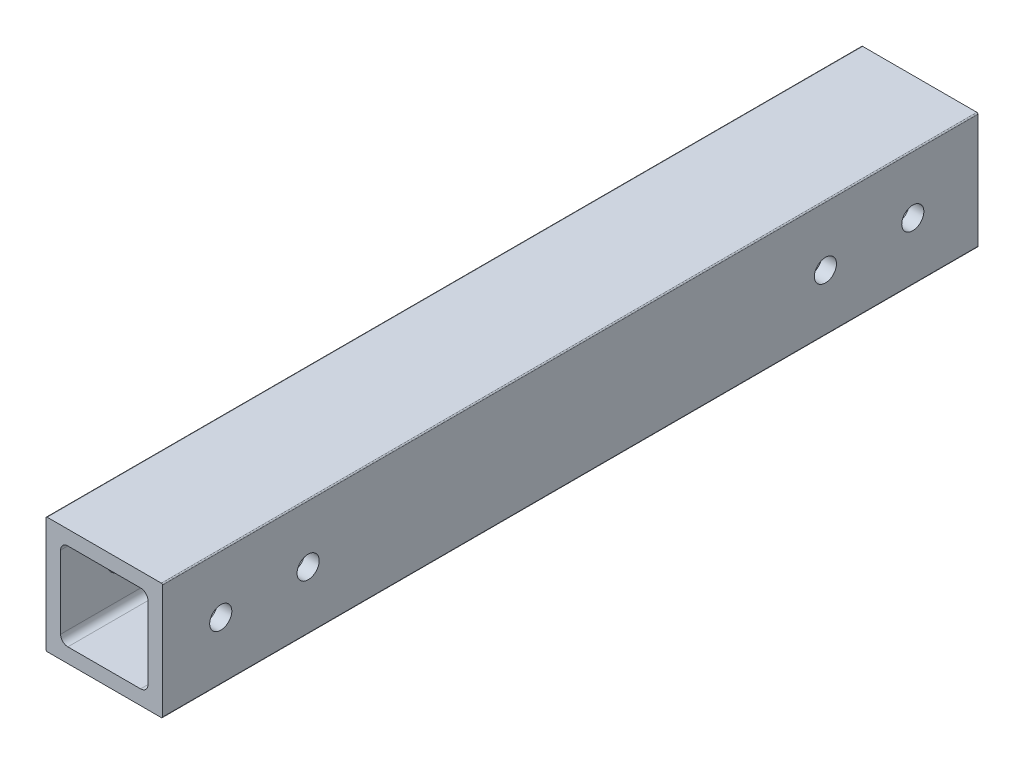
ISO-10303-21;
HEADER;
FILE_DESCRIPTION(('STEP AP214'),'2;1');
FILE_NAME('part.step','',(''),(''),'','','');
FILE_SCHEMA(('AUTOMOTIVE_DESIGN { 1 0 10303 214 1 1 1 1 }'));
ENDSEC;
DATA;
#1=APPLICATION_CONTEXT('core data for automotive mechanical design processes');
#2=APPLICATION_PROTOCOL_DEFINITION('international standard','automotive_design',2000,#1);
#3=PRODUCT_CONTEXT('',#1,'mechanical');
#4=PRODUCT('Part','Part','',(#3));
#5=PRODUCT_RELATED_PRODUCT_CATEGORY('part','',(#4));
#6=PRODUCT_DEFINITION_FORMATION('','',#4);
#7=PRODUCT_DEFINITION_CONTEXT('part definition',#1,'design');
#8=PRODUCT_DEFINITION('design','',#6,#7);
#9=PRODUCT_DEFINITION_SHAPE('','',#8);
#10=(LENGTH_UNIT() NAMED_UNIT(*) SI_UNIT(.MILLI.,.METRE.));
#11=(NAMED_UNIT(*) PLANE_ANGLE_UNIT() SI_UNIT($,.RADIAN.));
#12=(NAMED_UNIT(*) SI_UNIT($,.STERADIAN.) SOLID_ANGLE_UNIT());
#13=UNCERTAINTY_MEASURE_WITH_UNIT(LENGTH_MEASURE(1.E-05),#10,'distance_accuracy_value','');
#14=(GEOMETRIC_REPRESENTATION_CONTEXT(3) GLOBAL_UNCERTAINTY_ASSIGNED_CONTEXT((#13)) GLOBAL_UNIT_ASSIGNED_CONTEXT((#10,
#11,#12)) REPRESENTATION_CONTEXT('',''));
#15=CARTESIAN_POINT('',(0.,0.,0.));
#16=DIRECTION('',(0.,0.,1.));
#17=DIRECTION('',(1.,0.,0.));
#18=AXIS2_PLACEMENT_3D('',#15,#16,#17);
#19=CARTESIAN_POINT('',(3.175,4.7625,1828.8));
#20=DIRECTION('',(1.,0.,0.));
#21=DIRECTION('',(0.,1.,0.));
#22=AXIS2_PLACEMENT_3D('',#19,#20,#21);
#23=PLANE('',#22);
#24=CARTESIAN_POINT('',(3.175,12.7000000000002,1665.21621166384));
#25=DIRECTION('',(1.,0.,0.));
#26=DIRECTION('',(0.,0.,-1.));
#27=AXIS2_PLACEMENT_3D('',#24,#25,#26);
#28=CIRCLE('',#27,2.41299999999989);
#29=CARTESIAN_POINT('',(3.175,12.7000000000002,1662.80321166384));
#30=VERTEX_POINT('',#29);
#31=EDGE_CURVE('E316',#30,#30,#28,.T.);
#32=ORIENTED_EDGE('',*,*,#31,.F.);
#33=EDGE_LOOP('',(#32));
#34=FACE_BOUND('',#33,.T.);
#35=CARTESIAN_POINT('',(3.175,12.6999999999983,1797.05));
#36=DIRECTION('',(1.,0.,0.));
#37=DIRECTION('',(0.,0.,-1.));
#38=AXIS2_PLACEMENT_3D('',#35,#36,#37);
#39=CIRCLE('',#38,2.41299999999989);
#40=CARTESIAN_POINT('',(3.175,12.6999999999983,1794.637));
#41=VERTEX_POINT('',#40);
#42=EDGE_CURVE('E301',#41,#41,#39,.T.);
#43=ORIENTED_EDGE('',*,*,#42,.F.);
#44=EDGE_LOOP('',(#43));
#45=FACE_BOUND('',#44,.T.);
#46=CARTESIAN_POINT('',(3.175,12.6999999999983,1816.1));
#47=DIRECTION('',(1.,0.,0.));
#48=DIRECTION('',(0.,0.,-1.));
#49=AXIS2_PLACEMENT_3D('',#46,#47,#48);
#50=CIRCLE('',#49,2.41299999999989);
#51=CARTESIAN_POINT('',(3.175,12.6999999999983,1813.687));
#52=VERTEX_POINT('',#51);
#53=EDGE_CURVE('E297',#52,#52,#50,.T.);
#54=ORIENTED_EDGE('',*,*,#53,.F.);
#55=EDGE_LOOP('',(#54));
#56=FACE_BOUND('',#55,.T.);
#57=CARTESIAN_POINT('',(3.175,12.3513725490198,1684.26621166384));
#58=DIRECTION('',(1.,0.,0.));
#59=DIRECTION('',(0.,0.,-1.));
#60=AXIS2_PLACEMENT_3D('',#57,#58,#59);
#61=CIRCLE('',#60,2.4130000000001);
#62=CARTESIAN_POINT('',(3.175,12.3513725490198,1681.85321166384));
#63=VERTEX_POINT('',#62);
#64=EDGE_CURVE('E293',#63,#63,#61,.T.);
#65=ORIENTED_EDGE('',*,*,#64,.F.);
#66=EDGE_LOOP('',(#65));
#67=FACE_BOUND('',#66,.T.);
#68=DIRECTION('',(0.,-1.,0.));
#69=VECTOR('',#68,1.);
#70=CARTESIAN_POINT('',(3.175,4.7625,1651.));
#71=LINE('',#70,#69);
#72=CARTESIAN_POINT('',(3.175,20.6375,1651.));
#73=VERTEX_POINT('',#72);
#74=CARTESIAN_POINT('',(3.175,4.7625,1651.));
#75=VERTEX_POINT('',#74);
#76=EDGE_CURVE('E59',#73,#75,#71,.T.);
#77=ORIENTED_EDGE('',*,*,#76,.F.);
#78=DIRECTION('',(0.,0.,-1.));
#79=VECTOR('',#78,1.);
#80=CARTESIAN_POINT('',(3.175,20.6375,1828.8));
#81=LINE('',#80,#79);
#82=CARTESIAN_POINT('',(3.175,20.6375,1828.8));
#83=VERTEX_POINT('',#82);
#84=EDGE_CURVE('E51',#83,#73,#81,.T.);
#85=ORIENTED_EDGE('',*,*,#84,.F.);
#86=DIRECTION('',(0.,-1.,0.));
#87=VECTOR('',#86,1.);
#88=CARTESIAN_POINT('',(3.175,4.7625,1828.8));
#89=LINE('',#88,#87);
#90=CARTESIAN_POINT('',(3.175,4.7625,1828.8));
#91=VERTEX_POINT('',#90);
#92=EDGE_CURVE('E218',#83,#91,#89,.T.);
#93=ORIENTED_EDGE('',*,*,#92,.T.);
#94=DIRECTION('',(0.,0.,-1.));
#95=VECTOR('',#94,1.);
#96=CARTESIAN_POINT('',(3.175,4.7625,1828.8));
#97=LINE('',#96,#95);
#98=EDGE_CURVE('E344',#91,#75,#97,.T.);
#99=ORIENTED_EDGE('',*,*,#98,.T.);
#100=EDGE_LOOP('',(#77,#85,#93,#99));
#101=FACE_BOUND('',#100,.T.);
#102=ADVANCED_FACE('F42',(#34,#45,#56,#67,#101),#23,.T.);
#103=CARTESIAN_POINT('',(4.7625,20.6375,1828.8));
#104=DIRECTION('',(0.,0.,-1.));
#105=DIRECTION('',(-1.,0.,0.));
#106=AXIS2_PLACEMENT_3D('',#103,#104,#105);
#107=CYLINDRICAL_SURFACE('',#106,1.5875);
#108=ORIENTED_EDGE('',*,*,#84,.T.);
#109=CARTESIAN_POINT('',(4.7625,20.6375,1651.));
#110=DIRECTION('',(0.,0.,1.));
#111=DIRECTION('',(1.,0.,0.));
#112=AXIS2_PLACEMENT_3D('',#109,#110,#111);
#113=CIRCLE('',#112,1.5875);
#114=CARTESIAN_POINT('',(4.7625,22.225,1651.));
#115=VERTEX_POINT('',#114);
#116=EDGE_CURVE('E340',#73,#115,#113,.F.);
#117=ORIENTED_EDGE('',*,*,#116,.T.);
#118=DIRECTION('',(0.,0.,-1.));
#119=VECTOR('',#118,1.);
#120=CARTESIAN_POINT('',(4.7625,22.225,1828.8));
#121=LINE('',#120,#119);
#122=CARTESIAN_POINT('',(4.7625,22.225,1828.8));
#123=VERTEX_POINT('',#122);
#124=EDGE_CURVE('E351',#123,#115,#121,.T.);
#125=ORIENTED_EDGE('',*,*,#124,.F.);
#126=CARTESIAN_POINT('',(4.7625,20.6375,1828.8));
#127=DIRECTION('',(0.,0.,1.));
#128=DIRECTION('',(-1.,0.,0.));
#129=AXIS2_PLACEMENT_3D('',#126,#127,#128);
#130=CIRCLE('',#129,1.5875);
#131=EDGE_CURVE('E223',#123,#83,#130,.T.);
#132=ORIENTED_EDGE('',*,*,#131,.T.);
#133=EDGE_LOOP('',(#108,#117,#125,#132));
#134=FACE_BOUND('',#133,.T.);
#135=ADVANCED_FACE('F400',(#134),#107,.F.);
#136=CARTESIAN_POINT('',(4.7625,22.225,1828.8));
#137=DIRECTION('',(0.,-1.,0.));
#138=DIRECTION('',(0.,0.,-1.));
#139=AXIS2_PLACEMENT_3D('',#136,#137,#138);
#140=PLANE('',#139);
#141=DIRECTION('',(-1.,0.,0.));
#142=VECTOR('',#141,1.);
#143=CARTESIAN_POINT('',(4.7625,22.225,1651.));
#144=LINE('',#143,#142);
#145=CARTESIAN_POINT('',(20.6375,22.225,1651.));
#146=VERTEX_POINT('',#145);
#147=EDGE_CURVE('E338',#146,#115,#144,.T.);
#148=ORIENTED_EDGE('',*,*,#147,.F.);
#149=DIRECTION('',(0.,0.,-1.));
#150=VECTOR('',#149,1.);
#151=CARTESIAN_POINT('',(20.6375,22.225,1828.8));
#152=LINE('',#151,#150);
#153=CARTESIAN_POINT('',(20.6375,22.225,1828.8));
#154=VERTEX_POINT('',#153);
#155=EDGE_CURVE('E238',#154,#146,#152,.T.);
#156=ORIENTED_EDGE('',*,*,#155,.F.);
#157=DIRECTION('',(-1.,0.,0.));
#158=VECTOR('',#157,1.);
#159=CARTESIAN_POINT('',(4.7625,22.225,1828.8));
#160=LINE('',#159,#158);
#161=EDGE_CURVE('E227',#154,#123,#160,.T.);
#162=ORIENTED_EDGE('',*,*,#161,.T.);
#163=ORIENTED_EDGE('',*,*,#124,.T.);
#164=EDGE_LOOP('',(#148,#156,#162,#163));
#165=FACE_BOUND('',#164,.T.);
#166=ADVANCED_FACE('F396',(#165),#140,.T.);
#167=CARTESIAN_POINT('',(20.6375,20.6375,1828.8));
#168=DIRECTION('',(0.,0.,-1.));
#169=DIRECTION('',(-1.,0.,0.));
#170=AXIS2_PLACEMENT_3D('',#167,#168,#169);
#171=CYLINDRICAL_SURFACE('',#170,1.5875);
#172=ORIENTED_EDGE('',*,*,#155,.T.);
#173=CARTESIAN_POINT('',(20.6375,20.6375,1651.));
#174=DIRECTION('',(0.,0.,1.));
#175=DIRECTION('',(1.,0.,0.));
#176=AXIS2_PLACEMENT_3D('',#173,#174,#175);
#177=CIRCLE('',#176,1.5875);
#178=CARTESIAN_POINT('',(22.225,20.6375,1651.));
#179=VERTEX_POINT('',#178);
#180=EDGE_CURVE('E335',#146,#179,#177,.F.);
#181=ORIENTED_EDGE('',*,*,#180,.T.);
#182=DIRECTION('',(0.,0.,-1.));
#183=VECTOR('',#182,1.);
#184=CARTESIAN_POINT('',(22.225,20.6375,1828.8));
#185=LINE('',#184,#183);
#186=CARTESIAN_POINT('',(22.225,20.6375,1828.8));
#187=VERTEX_POINT('',#186);
#188=EDGE_CURVE('E234',#187,#179,#185,.T.);
#189=ORIENTED_EDGE('',*,*,#188,.F.);
#190=CARTESIAN_POINT('',(20.6375,20.6375,1828.8));
#191=DIRECTION('',(0.,0.,1.));
#192=DIRECTION('',(-1.,0.,0.));
#193=AXIS2_PLACEMENT_3D('',#190,#191,#192);
#194=CIRCLE('',#193,1.5875);
#195=EDGE_CURVE('E213',#187,#154,#194,.T.);
#196=ORIENTED_EDGE('',*,*,#195,.T.);
#197=EDGE_LOOP('',(#172,#181,#189,#196));
#198=FACE_BOUND('',#197,.T.);
#199=ADVANCED_FACE('F392',(#198),#171,.F.);
#200=CARTESIAN_POINT('',(22.225,4.7625,1828.8));
#201=DIRECTION('',(-1.,0.,0.));
#202=DIRECTION('',(0.,0.,1.));
#203=AXIS2_PLACEMENT_3D('',#200,#201,#202);
#204=PLANE('',#203);
#205=CARTESIAN_POINT('',(22.225,12.7000000000002,1665.21621166384));
#206=DIRECTION('',(-1.,0.,0.));
#207=DIRECTION('',(0.,0.,1.));
#208=AXIS2_PLACEMENT_3D('',#205,#206,#207);
#209=CIRCLE('',#208,2.41299999999989);
#210=CARTESIAN_POINT('',(22.225,12.7000000000002,1667.62921166384));
#211=VERTEX_POINT('',#210);
#212=EDGE_CURVE('E313',#211,#211,#209,.T.);
#213=ORIENTED_EDGE('',*,*,#212,.F.);
#214=EDGE_LOOP('',(#213));
#215=FACE_BOUND('',#214,.T.);
#216=CARTESIAN_POINT('',(22.225,12.6999999999983,1797.05));
#217=DIRECTION('',(-1.,0.,0.));
#218=DIRECTION('',(0.,0.,1.));
#219=AXIS2_PLACEMENT_3D('',#216,#217,#218);
#220=CIRCLE('',#219,2.41299999999989);
#221=CARTESIAN_POINT('',(22.225,12.6999999999983,1799.463));
#222=VERTEX_POINT('',#221);
#223=EDGE_CURVE('E296',#222,#222,#220,.T.);
#224=ORIENTED_EDGE('',*,*,#223,.F.);
#225=EDGE_LOOP('',(#224));
#226=FACE_BOUND('',#225,.T.);
#227=CARTESIAN_POINT('',(22.225,12.6999999999983,1816.1));
#228=DIRECTION('',(-1.,0.,0.));
#229=DIRECTION('',(0.,0.,1.));
#230=AXIS2_PLACEMENT_3D('',#227,#228,#229);
#231=CIRCLE('',#230,2.41299999999989);
#232=CARTESIAN_POINT('',(22.225,12.6999999999983,1818.513));
#233=VERTEX_POINT('',#232);
#234=EDGE_CURVE('E292',#233,#233,#231,.T.);
#235=ORIENTED_EDGE('',*,*,#234,.F.);
#236=EDGE_LOOP('',(#235));
#237=FACE_BOUND('',#236,.T.);
#238=CARTESIAN_POINT('',(22.225,12.3513725490198,1684.26621166384));
#239=DIRECTION('',(-1.,0.,0.));
#240=DIRECTION('',(0.,0.,1.));
#241=AXIS2_PLACEMENT_3D('',#238,#239,#240);
#242=CIRCLE('',#241,2.4130000000001);
#243=CARTESIAN_POINT('',(22.225,12.3513725490198,1686.67921166384));
#244=VERTEX_POINT('',#243);
#245=EDGE_CURVE('E288',#244,#244,#242,.T.);
#246=ORIENTED_EDGE('',*,*,#245,.F.);
#247=EDGE_LOOP('',(#246));
#248=FACE_BOUND('',#247,.T.);
#249=DIRECTION('',(0.,1.,0.));
#250=VECTOR('',#249,1.);
#251=CARTESIAN_POINT('',(22.225,4.7625,1651.));
#252=LINE('',#251,#250);
#253=CARTESIAN_POINT('',(22.225,4.7625,1651.));
#254=VERTEX_POINT('',#253);
#255=EDGE_CURVE('E333',#254,#179,#252,.T.);
#256=ORIENTED_EDGE('',*,*,#255,.F.);
#257=DIRECTION('',(0.,0.,-1.));
#258=VECTOR('',#257,1.);
#259=CARTESIAN_POINT('',(22.225,4.7625,1828.8));
#260=LINE('',#259,#258);
#261=CARTESIAN_POINT('',(22.225,4.7625,1828.8));
#262=VERTEX_POINT('',#261);
#263=EDGE_CURVE('E239',#262,#254,#260,.T.);
#264=ORIENTED_EDGE('',*,*,#263,.F.);
#265=DIRECTION('',(0.,1.,0.));
#266=VECTOR('',#265,1.);
#267=CARTESIAN_POINT('',(22.225,4.7625,1828.8));
#268=LINE('',#267,#266);
#269=EDGE_CURVE('E209',#262,#187,#268,.T.);
#270=ORIENTED_EDGE('',*,*,#269,.T.);
#271=ORIENTED_EDGE('',*,*,#188,.T.);
#272=EDGE_LOOP('',(#256,#264,#270,#271));
#273=FACE_BOUND('',#272,.T.);
#274=ADVANCED_FACE('F390',(#215,#226,#237,#248,#273),#204,.T.);
#275=CARTESIAN_POINT('',(20.6375,4.7625,1828.8));
#276=DIRECTION('',(0.,0.,-1.));
#277=DIRECTION('',(-1.,0.,0.));
#278=AXIS2_PLACEMENT_3D('',#275,#276,#277);
#279=CYLINDRICAL_SURFACE('',#278,1.5875);
#280=ORIENTED_EDGE('',*,*,#263,.T.);
#281=CARTESIAN_POINT('',(20.6375,4.7625,1651.));
#282=DIRECTION('',(0.,0.,1.));
#283=DIRECTION('',(1.,0.,0.));
#284=AXIS2_PLACEMENT_3D('',#281,#282,#283);
#285=CIRCLE('',#284,1.5875);
#286=CARTESIAN_POINT('',(20.6375,3.175,1651.));
#287=VERTEX_POINT('',#286);
#288=EDGE_CURVE('E330',#254,#287,#285,.F.);
#289=ORIENTED_EDGE('',*,*,#288,.T.);
#290=DIRECTION('',(0.,0.,-1.));
#291=VECTOR('',#290,1.);
#292=CARTESIAN_POINT('',(20.6375,3.175,1828.8));
#293=LINE('',#292,#291);
#294=CARTESIAN_POINT('',(20.6375,3.175,1828.8));
#295=VERTEX_POINT('',#294);
#296=EDGE_CURVE('E265',#295,#287,#293,.T.);
#297=ORIENTED_EDGE('',*,*,#296,.F.);
#298=CARTESIAN_POINT('',(20.6375,4.7625,1828.8));
#299=DIRECTION('',(0.,0.,1.));
#300=DIRECTION('',(-1.,0.,0.));
#301=AXIS2_PLACEMENT_3D('',#298,#299,#300);
#302=CIRCLE('',#301,1.5875);
#303=EDGE_CURVE('E212',#295,#262,#302,.T.);
#304=ORIENTED_EDGE('',*,*,#303,.T.);
#305=EDGE_LOOP('',(#280,#289,#297,#304));
#306=FACE_BOUND('',#305,.T.);
#307=ADVANCED_FACE('F387',(#306),#279,.F.);
#308=CARTESIAN_POINT('',(4.7625,3.175,1828.8));
#309=DIRECTION('',(0.,1.,0.));
#310=DIRECTION('',(1.,0.,0.));
#311=AXIS2_PLACEMENT_3D('',#308,#309,#310);
#312=PLANE('',#311);
#313=DIRECTION('',(1.,0.,0.));
#314=VECTOR('',#313,1.);
#315=CARTESIAN_POINT('',(4.7625,3.175,1651.));
#316=LINE('',#315,#314);
#317=CARTESIAN_POINT('',(4.7625,3.175,1651.));
#318=VERTEX_POINT('',#317);
#319=EDGE_CURVE('E328',#318,#287,#316,.T.);
#320=ORIENTED_EDGE('',*,*,#319,.F.);
#321=DIRECTION('',(0.,0.,-1.));
#322=VECTOR('',#321,1.);
#323=CARTESIAN_POINT('',(4.7625,3.175,1828.8));
#324=LINE('',#323,#322);
#325=CARTESIAN_POINT('',(4.7625,3.175,1828.8));
#326=VERTEX_POINT('',#325);
#327=EDGE_CURVE('E269',#326,#318,#324,.T.);
#328=ORIENTED_EDGE('',*,*,#327,.F.);
#329=DIRECTION('',(1.,0.,0.));
#330=VECTOR('',#329,1.);
#331=CARTESIAN_POINT('',(4.7625,3.175,1828.8));
#332=LINE('',#331,#330);
#333=EDGE_CURVE('E255',#326,#295,#332,.T.);
#334=ORIENTED_EDGE('',*,*,#333,.T.);
#335=ORIENTED_EDGE('',*,*,#296,.T.);
#336=EDGE_LOOP('',(#320,#328,#334,#335));
#337=FACE_BOUND('',#336,.T.);
#338=ADVANCED_FACE('F378',(#337),#312,.T.);
#339=CARTESIAN_POINT('',(4.7625,4.7625,1828.8));
#340=DIRECTION('',(0.,0.,-1.));
#341=DIRECTION('',(-1.,0.,0.));
#342=AXIS2_PLACEMENT_3D('',#339,#340,#341);
#343=CYLINDRICAL_SURFACE('',#342,1.5875);
#344=ORIENTED_EDGE('',*,*,#327,.T.);
#345=CARTESIAN_POINT('',(4.7625,4.7625,1651.));
#346=DIRECTION('',(0.,0.,1.));
#347=DIRECTION('',(1.,0.,0.));
#348=AXIS2_PLACEMENT_3D('',#345,#346,#347);
#349=CIRCLE('',#348,1.5875);
#350=EDGE_CURVE('E326',#318,#75,#349,.F.);
#351=ORIENTED_EDGE('',*,*,#350,.T.);
#352=ORIENTED_EDGE('',*,*,#98,.F.);
#353=CARTESIAN_POINT('',(4.7625,4.7625,1828.8));
#354=DIRECTION('',(0.,0.,1.));
#355=DIRECTION('',(1.,0.,0.));
#356=AXIS2_PLACEMENT_3D('',#353,#354,#355);
#357=CIRCLE('',#356,1.5875);
#358=EDGE_CURVE('E214',#91,#326,#357,.T.);
#359=ORIENTED_EDGE('',*,*,#358,.T.);
#360=EDGE_LOOP('',(#344,#351,#352,#359));
#361=FACE_BOUND('',#360,.T.);
#362=ADVANCED_FACE('F373',(#361),#343,.F.);
#363=CARTESIAN_POINT('',(0.,0.254,1828.8));
#364=DIRECTION('',(1.,0.,0.));
#365=DIRECTION('',(0.,1.,0.));
#366=AXIS2_PLACEMENT_3D('',#363,#364,#365);
#367=PLANE('',#366);
#368=CARTESIAN_POINT('',(0.,12.7000000000002,1665.21621166384));
#369=DIRECTION('',(1.,0.,0.));
#370=DIRECTION('',(0.,0.,-1.));
#371=AXIS2_PLACEMENT_3D('',#368,#369,#370);
#372=CIRCLE('',#371,2.41299999999989);
#373=CARTESIAN_POINT('',(0.,12.7000000000002,1662.80321166384));
#374=VERTEX_POINT('',#373);
#375=EDGE_CURVE('E289',#374,#374,#372,.T.);
#376=ORIENTED_EDGE('',*,*,#375,.T.);
#377=EDGE_LOOP('',(#376));
#378=FACE_BOUND('',#377,.T.);
#379=CARTESIAN_POINT('',(0.,12.6999999999983,1797.05));
#380=DIRECTION('',(1.,0.,0.));
#381=DIRECTION('',(0.,0.,-1.));
#382=AXIS2_PLACEMENT_3D('',#379,#380,#381);
#383=CIRCLE('',#382,2.41299999999989);
#384=CARTESIAN_POINT('',(0.,12.6999999999983,1794.637));
#385=VERTEX_POINT('',#384);
#386=EDGE_CURVE('E579',#385,#385,#383,.T.);
#387=ORIENTED_EDGE('',*,*,#386,.T.);
#388=EDGE_LOOP('',(#387));
#389=FACE_BOUND('',#388,.T.);
#390=CARTESIAN_POINT('',(0.,12.6999999999983,1816.1));
#391=DIRECTION('',(1.,0.,0.));
#392=DIRECTION('',(0.,0.,-1.));
#393=AXIS2_PLACEMENT_3D('',#390,#391,#392);
#394=CIRCLE('',#393,2.41299999999989);
#395=CARTESIAN_POINT('',(0.,12.6999999999983,1813.687));
#396=VERTEX_POINT('',#395);
#397=EDGE_CURVE('E576',#396,#396,#394,.T.);
#398=ORIENTED_EDGE('',*,*,#397,.T.);
#399=EDGE_LOOP('',(#398));
#400=FACE_BOUND('',#399,.T.);
#401=CARTESIAN_POINT('',(0.,12.3513725490198,1684.26621166384));
#402=DIRECTION('',(1.,0.,0.));
#403=DIRECTION('',(0.,0.,-1.));
#404=AXIS2_PLACEMENT_3D('',#401,#402,#403);
#405=CIRCLE('',#404,2.4130000000001);
#406=CARTESIAN_POINT('',(0.,12.3513725490198,1681.85321166384));
#407=VERTEX_POINT('',#406);
#408=EDGE_CURVE('E573',#407,#407,#405,.T.);
#409=ORIENTED_EDGE('',*,*,#408,.T.);
#410=EDGE_LOOP('',(#409));
#411=FACE_BOUND('',#410,.T.);
#412=DIRECTION('',(0.,0.,-1.));
#413=VECTOR('',#412,1.);
#414=CARTESIAN_POINT('',(0.,25.146,1828.8));
#415=LINE('',#414,#413);
#416=CARTESIAN_POINT('',(0.,25.146,1828.8));
#417=VERTEX_POINT('',#416);
#418=CARTESIAN_POINT('',(0.,25.146,1651.));
#419=VERTEX_POINT('',#418);
#420=EDGE_CURVE('E264',#417,#419,#415,.T.);
#421=ORIENTED_EDGE('',*,*,#420,.T.);
#422=DIRECTION('',(0.,-1.,0.));
#423=VECTOR('',#422,1.);
#424=CARTESIAN_POINT('',(0.,0.254,1651.));
#425=LINE('',#424,#423);
#426=CARTESIAN_POINT('',(0.,0.254,1651.));
#427=VERTEX_POINT('',#426);
#428=EDGE_CURVE('E186',#419,#427,#425,.T.);
#429=ORIENTED_EDGE('',*,*,#428,.T.);
#430=DIRECTION('',(0.,0.,-1.));
#431=VECTOR('',#430,1.);
#432=CARTESIAN_POINT('',(0.,0.254,1828.8));
#433=LINE('',#432,#431);
#434=CARTESIAN_POINT('',(0.,0.254,1828.8));
#435=VERTEX_POINT('',#434);
#436=EDGE_CURVE('E195',#435,#427,#433,.T.);
#437=ORIENTED_EDGE('',*,*,#436,.F.);
#438=DIRECTION('',(0.,-1.,0.));
#439=VECTOR('',#438,1.);
#440=CARTESIAN_POINT('',(0.,0.254,1828.8));
#441=LINE('',#440,#439);
#442=EDGE_CURVE('E219',#417,#435,#441,.T.);
#443=ORIENTED_EDGE('',*,*,#442,.F.);
#444=EDGE_LOOP('',(#421,#429,#437,#443));
#445=FACE_BOUND('',#444,.T.);
#446=ADVANCED_FACE('F433',(#378,#389,#400,#411,#445),#367,.F.);
#447=CARTESIAN_POINT('',(0.254,25.146,1828.8));
#448=DIRECTION('',(0.,0.,-1.));
#449=DIRECTION('',(-1.,0.,0.));
#450=AXIS2_PLACEMENT_3D('',#447,#448,#449);
#451=CYLINDRICAL_SURFACE('',#450,0.254);
#452=CARTESIAN_POINT('',(0.254,25.146,1651.));
#453=DIRECTION('',(0.,0.,1.));
#454=DIRECTION('',(1.,0.,0.));
#455=AXIS2_PLACEMENT_3D('',#452,#453,#454);
#456=CIRCLE('',#455,0.254);
#457=CARTESIAN_POINT('',(0.254000000000004,25.4,1651.));
#458=VERTEX_POINT('',#457);
#459=EDGE_CURVE('E177',#419,#458,#456,.F.);
#460=ORIENTED_EDGE('',*,*,#459,.F.);
#461=ORIENTED_EDGE('',*,*,#420,.F.);
#462=CARTESIAN_POINT('',(0.254,25.146,1828.8));
#463=DIRECTION('',(0.,0.,1.));
#464=DIRECTION('',(-1.,0.,0.));
#465=AXIS2_PLACEMENT_3D('',#462,#463,#464);
#466=CIRCLE('',#465,0.254);
#467=CARTESIAN_POINT('',(0.254,25.4,1828.8));
#468=VERTEX_POINT('',#467);
#469=EDGE_CURVE('E240',#468,#417,#466,.T.);
#470=ORIENTED_EDGE('',*,*,#469,.F.);
#471=DIRECTION('',(0.,0.,-1.));
#472=VECTOR('',#471,1.);
#473=CARTESIAN_POINT('',(0.254,25.4,1828.8));
#474=LINE('',#473,#472);
#475=EDGE_CURVE('E260',#468,#458,#474,.T.);
#476=ORIENTED_EDGE('',*,*,#475,.T.);
#477=EDGE_LOOP('',(#460,#461,#470,#476));
#478=FACE_BOUND('',#477,.T.);
#479=ADVANCED_FACE('F429',(#478),#451,.T.);
#480=CARTESIAN_POINT('',(0.254,25.4,1828.8));
#481=DIRECTION('',(0.,-1.,0.));
#482=DIRECTION('',(0.,0.,-1.));
#483=AXIS2_PLACEMENT_3D('',#480,#481,#482);
#484=PLANE('',#483);
#485=DIRECTION('',(0.,0.,-1.));
#486=VECTOR('',#485,1.);
#487=CARTESIAN_POINT('',(25.146,25.4,1828.8));
#488=LINE('',#487,#486);
#489=CARTESIAN_POINT('',(25.146,25.4,1828.8));
#490=VERTEX_POINT('',#489);
#491=CARTESIAN_POINT('',(25.146,25.4,1651.));
#492=VERTEX_POINT('',#491);
#493=EDGE_CURVE('E256',#490,#492,#488,.T.);
#494=ORIENTED_EDGE('',*,*,#493,.T.);
#495=DIRECTION('',(1.,0.,0.));
#496=VECTOR('',#495,1.);
#497=CARTESIAN_POINT('',(-135.222379220066,25.4,1651.));
#498=LINE('',#497,#496);
#499=EDGE_CURVE('E187',#458,#492,#498,.T.);
#500=ORIENTED_EDGE('',*,*,#499,.F.);
#501=ORIENTED_EDGE('',*,*,#475,.F.);
#502=DIRECTION('',(-1.,0.,0.));
#503=VECTOR('',#502,1.);
#504=CARTESIAN_POINT('',(0.254,25.4,1828.8));
#505=LINE('',#504,#503);
#506=EDGE_CURVE('E232',#490,#468,#505,.T.);
#507=ORIENTED_EDGE('',*,*,#506,.F.);
#508=EDGE_LOOP('',(#494,#500,#501,#507));
#509=FACE_BOUND('',#508,.T.);
#510=ADVANCED_FACE('F432',(#509),#484,.F.);
#511=CARTESIAN_POINT('',(25.146,25.146,1828.8));
#512=DIRECTION('',(0.,0.,-1.));
#513=DIRECTION('',(-1.,0.,0.));
#514=AXIS2_PLACEMENT_3D('',#511,#512,#513);
#515=CYLINDRICAL_SURFACE('',#514,0.254);
#516=CARTESIAN_POINT('',(25.146,25.146,1651.));
#517=DIRECTION('',(0.,0.,1.));
#518=DIRECTION('',(1.,0.,0.));
#519=AXIS2_PLACEMENT_3D('',#516,#517,#518);
#520=CIRCLE('',#519,0.254);
#521=CARTESIAN_POINT('',(25.4,25.146,1651.));
#522=VERTEX_POINT('',#521);
#523=EDGE_CURVE('E324',#492,#522,#520,.F.);
#524=ORIENTED_EDGE('',*,*,#523,.F.);
#525=ORIENTED_EDGE('',*,*,#493,.F.);
#526=CARTESIAN_POINT('',(25.146,25.146,1828.8));
#527=DIRECTION('',(0.,0.,1.));
#528=DIRECTION('',(-1.,0.,0.));
#529=AXIS2_PLACEMENT_3D('',#526,#527,#528);
#530=CIRCLE('',#529,0.254);
#531=CARTESIAN_POINT('',(25.4,25.146,1828.8));
#532=VERTEX_POINT('',#531);
#533=EDGE_CURVE('E228',#532,#490,#530,.T.);
#534=ORIENTED_EDGE('',*,*,#533,.F.);
#535=DIRECTION('',(0.,0.,-1.));
#536=VECTOR('',#535,1.);
#537=CARTESIAN_POINT('',(25.4,25.146,1828.8));
#538=LINE('',#537,#536);
#539=EDGE_CURVE('E201',#532,#522,#538,.T.);
#540=ORIENTED_EDGE('',*,*,#539,.T.);
#541=EDGE_LOOP('',(#524,#525,#534,#540));
#542=FACE_BOUND('',#541,.T.);
#543=ADVANCED_FACE('F44',(#542),#515,.T.);
#544=CARTESIAN_POINT('',(25.4,0.254,1828.8));
#545=DIRECTION('',(-1.,0.,0.));
#546=DIRECTION('',(0.,0.,1.));
#547=AXIS2_PLACEMENT_3D('',#544,#545,#546);
#548=PLANE('',#547);
#549=CARTESIAN_POINT('',(25.4,12.7000000000002,1665.21621166384));
#550=DIRECTION('',(-1.,0.,0.));
#551=DIRECTION('',(0.,0.,1.));
#552=AXIS2_PLACEMENT_3D('',#549,#550,#551);
#553=CIRCLE('',#552,2.41299999999989);
#554=CARTESIAN_POINT('',(25.4,12.7000000000002,1667.62921166384));
#555=VERTEX_POINT('',#554);
#556=EDGE_CURVE('E46',#555,#555,#553,.T.);
#557=ORIENTED_EDGE('',*,*,#556,.T.);
#558=EDGE_LOOP('',(#557));
#559=FACE_BOUND('',#558,.T.);
#560=CARTESIAN_POINT('',(25.4,12.6999999999983,1797.05));
#561=DIRECTION('',(-1.,0.,0.));
#562=DIRECTION('',(0.,0.,1.));
#563=AXIS2_PLACEMENT_3D('',#560,#561,#562);
#564=CIRCLE('',#563,2.41299999999989);
#565=CARTESIAN_POINT('',(25.4,12.6999999999983,1799.463));
#566=VERTEX_POINT('',#565);
#567=EDGE_CURVE('E294',#566,#566,#564,.T.);
#568=ORIENTED_EDGE('',*,*,#567,.T.);
#569=EDGE_LOOP('',(#568));
#570=FACE_BOUND('',#569,.T.);
#571=CARTESIAN_POINT('',(25.4,12.6999999999983,1816.1));
#572=DIRECTION('',(-1.,0.,0.));
#573=DIRECTION('',(0.,0.,1.));
#574=AXIS2_PLACEMENT_3D('',#571,#572,#573);
#575=CIRCLE('',#574,2.41299999999989);
#576=CARTESIAN_POINT('',(25.4,12.6999999999983,1818.513));
#577=VERTEX_POINT('',#576);
#578=EDGE_CURVE('E290',#577,#577,#575,.T.);
#579=ORIENTED_EDGE('',*,*,#578,.T.);
#580=EDGE_LOOP('',(#579));
#581=FACE_BOUND('',#580,.T.);
#582=CARTESIAN_POINT('',(25.4,12.3513725490198,1684.26621166384));
#583=DIRECTION('',(-1.,0.,0.));
#584=DIRECTION('',(0.,0.,1.));
#585=AXIS2_PLACEMENT_3D('',#582,#583,#584);
#586=CIRCLE('',#585,2.4130000000001);
#587=CARTESIAN_POINT('',(25.4,12.3513725490198,1686.67921166384));
#588=VERTEX_POINT('',#587);
#589=EDGE_CURVE('E285',#588,#588,#586,.T.);
#590=ORIENTED_EDGE('',*,*,#589,.T.);
#591=EDGE_LOOP('',(#590));
#592=FACE_BOUND('',#591,.T.);
#593=DIRECTION('',(0.,0.,-1.));
#594=VECTOR('',#593,1.);
#595=CARTESIAN_POINT('',(25.4,0.254,1828.8));
#596=LINE('',#595,#594);
#597=CARTESIAN_POINT('',(25.4,0.254,1828.8));
#598=VERTEX_POINT('',#597);
#599=CARTESIAN_POINT('',(25.4,0.254,1651.));
#600=VERTEX_POINT('',#599);
#601=EDGE_CURVE('E194',#598,#600,#596,.T.);
#602=ORIENTED_EDGE('',*,*,#601,.T.);
#603=DIRECTION('',(0.,1.,0.));
#604=VECTOR('',#603,1.);
#605=CARTESIAN_POINT('',(25.4,0.254,1651.));
#606=LINE('',#605,#604);
#607=EDGE_CURVE('E173',#600,#522,#606,.T.);
#608=ORIENTED_EDGE('',*,*,#607,.T.);
#609=ORIENTED_EDGE('',*,*,#539,.F.);
#610=DIRECTION('',(0.,1.,0.));
#611=VECTOR('',#610,1.);
#612=CARTESIAN_POINT('',(25.4,0.254,1828.8));
#613=LINE('',#612,#611);
#614=EDGE_CURVE('E233',#598,#532,#613,.T.);
#615=ORIENTED_EDGE('',*,*,#614,.F.);
#616=EDGE_LOOP('',(#602,#608,#609,#615));
#617=FACE_BOUND('',#616,.T.);
#618=ADVANCED_FACE('F423',(#559,#570,#581,#592,#617),#548,.F.);
#619=CARTESIAN_POINT('',(25.146,0.254,1828.8));
#620=DIRECTION('',(0.,0.,-1.));
#621=DIRECTION('',(-1.,0.,0.));
#622=AXIS2_PLACEMENT_3D('',#619,#620,#621);
#623=CYLINDRICAL_SURFACE('',#622,0.254);
#624=CARTESIAN_POINT('',(25.146,0.254,1651.));
#625=DIRECTION('',(0.,0.,1.));
#626=DIRECTION('',(1.,0.,0.));
#627=AXIS2_PLACEMENT_3D('',#624,#625,#626);
#628=CIRCLE('',#627,0.254);
#629=CARTESIAN_POINT('',(25.146,0.,1651.));
#630=VERTEX_POINT('',#629);
#631=EDGE_CURVE('E170',#600,#630,#628,.F.);
#632=ORIENTED_EDGE('',*,*,#631,.F.);
#633=ORIENTED_EDGE('',*,*,#601,.F.);
#634=CARTESIAN_POINT('',(25.146,0.254,1828.8));
#635=DIRECTION('',(0.,0.,1.));
#636=DIRECTION('',(1.,0.,0.));
#637=AXIS2_PLACEMENT_3D('',#634,#635,#636);
#638=CIRCLE('',#637,0.254);
#639=CARTESIAN_POINT('',(25.146,0.,1828.8));
#640=VERTEX_POINT('',#639);
#641=EDGE_CURVE('E191',#640,#598,#638,.T.);
#642=ORIENTED_EDGE('',*,*,#641,.F.);
#643=DIRECTION('',(0.,0.,-1.));
#644=VECTOR('',#643,1.);
#645=CARTESIAN_POINT('',(25.146,0.,1828.8));
#646=LINE('',#645,#644);
#647=EDGE_CURVE('E183',#640,#630,#646,.T.);
#648=ORIENTED_EDGE('',*,*,#647,.T.);
#649=EDGE_LOOP('',(#632,#633,#642,#648));
#650=FACE_BOUND('',#649,.T.);
#651=ADVANCED_FACE('F189',(#650),#623,.T.);
#652=CARTESIAN_POINT('',(0.254,0.,1828.8));
#653=DIRECTION('',(0.,1.,0.));
#654=DIRECTION('',(1.,0.,0.));
#655=AXIS2_PLACEMENT_3D('',#652,#653,#654);
#656=PLANE('',#655);
#657=DIRECTION('',(0.,0.,-1.));
#658=VECTOR('',#657,1.);
#659=CARTESIAN_POINT('',(0.254,0.,1828.8));
#660=LINE('',#659,#658);
#661=CARTESIAN_POINT('',(0.254,0.,1828.8));
#662=VERTEX_POINT('',#661);
#663=CARTESIAN_POINT('',(0.254,0.,1651.));
#664=VERTEX_POINT('',#663);
#665=EDGE_CURVE('E185',#662,#664,#660,.T.);
#666=ORIENTED_EDGE('',*,*,#665,.T.);
#667=DIRECTION('',(-1.,0.,0.));
#668=VECTOR('',#667,1.);
#669=CARTESIAN_POINT('',(-135.222379220066,0.,1651.));
#670=LINE('',#669,#668);
#671=EDGE_CURVE('E66',#630,#664,#670,.T.);
#672=ORIENTED_EDGE('',*,*,#671,.F.);
#673=ORIENTED_EDGE('',*,*,#647,.F.);
#674=DIRECTION('',(1.,0.,0.));
#675=VECTOR('',#674,1.);
#676=CARTESIAN_POINT('',(0.254,0.,1828.8));
#677=LINE('',#676,#675);
#678=EDGE_CURVE('E249',#662,#640,#677,.T.);
#679=ORIENTED_EDGE('',*,*,#678,.F.);
#680=EDGE_LOOP('',(#666,#672,#673,#679));
#681=FACE_BOUND('',#680,.T.);
#682=ADVANCED_FACE('F181',(#681),#656,.F.);
#683=CARTESIAN_POINT('',(0.254,0.254,1828.8));
#684=DIRECTION('',(0.,0.,-1.));
#685=DIRECTION('',(-1.,0.,0.));
#686=AXIS2_PLACEMENT_3D('',#683,#684,#685);
#687=CYLINDRICAL_SURFACE('',#686,0.254);
#688=CARTESIAN_POINT('',(0.254,0.254,1651.));
#689=DIRECTION('',(0.,0.,1.));
#690=DIRECTION('',(1.,0.,0.));
#691=AXIS2_PLACEMENT_3D('',#688,#689,#690);
#692=CIRCLE('',#691,0.254);
#693=EDGE_CURVE('E11',#664,#427,#692,.F.);
#694=ORIENTED_EDGE('',*,*,#693,.F.);
#695=ORIENTED_EDGE('',*,*,#665,.F.);
#696=CARTESIAN_POINT('',(0.254,0.254,1828.8));
#697=DIRECTION('',(0.,0.,1.));
#698=DIRECTION('',(-1.,0.,0.));
#699=AXIS2_PLACEMENT_3D('',#696,#697,#698);
#700=CIRCLE('',#699,0.254);
#701=EDGE_CURVE('E252',#435,#662,#700,.T.);
#702=ORIENTED_EDGE('',*,*,#701,.F.);
#703=ORIENTED_EDGE('',*,*,#436,.T.);
#704=EDGE_LOOP('',(#694,#695,#702,#703));
#705=FACE_BOUND('',#704,.T.);
#706=ADVANCED_FACE('F415',(#705),#687,.T.);
#707=CARTESIAN_POINT('',(0.254,0.254,1828.8));
#708=DIRECTION('',(0.,0.,-1.));
#709=DIRECTION('',(0.,-1.,0.));
#710=AXIS2_PLACEMENT_3D('',#707,#708,#709);
#711=PLANE('',#710);
#712=ORIENTED_EDGE('',*,*,#358,.F.);
#713=ORIENTED_EDGE('',*,*,#92,.F.);
#714=ORIENTED_EDGE('',*,*,#131,.F.);
#715=ORIENTED_EDGE('',*,*,#161,.F.);
#716=ORIENTED_EDGE('',*,*,#195,.F.);
#717=ORIENTED_EDGE('',*,*,#269,.F.);
#718=ORIENTED_EDGE('',*,*,#303,.F.);
#719=ORIENTED_EDGE('',*,*,#333,.F.);
#720=EDGE_LOOP('',(#712,#713,#714,#715,#716,#717,#718,#719));
#721=FACE_BOUND('',#720,.T.);
#722=ORIENTED_EDGE('',*,*,#701,.T.);
#723=ORIENTED_EDGE('',*,*,#678,.T.);
#724=ORIENTED_EDGE('',*,*,#641,.T.);
#725=ORIENTED_EDGE('',*,*,#614,.T.);
#726=ORIENTED_EDGE('',*,*,#533,.T.);
#727=ORIENTED_EDGE('',*,*,#506,.T.);
#728=ORIENTED_EDGE('',*,*,#469,.T.);
#729=ORIENTED_EDGE('',*,*,#442,.T.);
#730=EDGE_LOOP('',(#722,#723,#724,#725,#726,#727,#728,#729));
#731=FACE_BOUND('',#730,.T.);
#732=ADVANCED_FACE('F381',(#721,#731),#711,.F.);
#733=CARTESIAN_POINT('',(-135.222379220066,-1672.98691034565,1651.));
#734=DIRECTION('',(0.,0.,1.));
#735=DIRECTION('',(1.,0.,0.));
#736=AXIS2_PLACEMENT_3D('',#733,#734,#735);
#737=PLANE('',#736);
#738=ORIENTED_EDGE('',*,*,#76,.T.);
#739=ORIENTED_EDGE('',*,*,#350,.F.);
#740=ORIENTED_EDGE('',*,*,#319,.T.);
#741=ORIENTED_EDGE('',*,*,#288,.F.);
#742=ORIENTED_EDGE('',*,*,#255,.T.);
#743=ORIENTED_EDGE('',*,*,#180,.F.);
#744=ORIENTED_EDGE('',*,*,#147,.T.);
#745=ORIENTED_EDGE('',*,*,#116,.F.);
#746=EDGE_LOOP('',(#738,#739,#740,#741,#742,#743,#744,#745));
#747=FACE_BOUND('',#746,.T.);
#748=ORIENTED_EDGE('',*,*,#523,.T.);
#749=ORIENTED_EDGE('',*,*,#607,.F.);
#750=ORIENTED_EDGE('',*,*,#631,.T.);
#751=ORIENTED_EDGE('',*,*,#671,.T.);
#752=ORIENTED_EDGE('',*,*,#693,.T.);
#753=ORIENTED_EDGE('',*,*,#428,.F.);
#754=ORIENTED_EDGE('',*,*,#459,.T.);
#755=ORIENTED_EDGE('',*,*,#499,.T.);
#756=EDGE_LOOP('',(#748,#749,#750,#751,#752,#753,#754,#755));
#757=FACE_BOUND('',#756,.T.);
#758=ADVANCED_FACE('F171',(#747,#757),#737,.F.);
#759=CARTESIAN_POINT('',(0.,12.3513725490198,1684.26621166384));
#760=DIRECTION('',(1.,0.,0.));
#761=DIRECTION('',(0.,0.,-1.));
#762=AXIS2_PLACEMENT_3D('',#759,#760,#761);
#763=CYLINDRICAL_SURFACE('',#762,2.4130000000001);
#764=ORIENTED_EDGE('',*,*,#245,.T.);
#765=EDGE_LOOP('',(#764));
#766=FACE_BOUND('',#765,.T.);
#767=ORIENTED_EDGE('',*,*,#589,.F.);
#768=EDGE_LOOP('',(#767));
#769=FACE_BOUND('',#768,.T.);
#770=ADVANCED_FACE('F492',(#766,#769),#763,.F.);
#771=CARTESIAN_POINT('',(0.,12.6999999999983,1816.1));
#772=DIRECTION('',(1.,0.,0.));
#773=DIRECTION('',(0.,0.,-1.));
#774=AXIS2_PLACEMENT_3D('',#771,#772,#773);
#775=CYLINDRICAL_SURFACE('',#774,2.41299999999989);
#776=ORIENTED_EDGE('',*,*,#234,.T.);
#777=EDGE_LOOP('',(#776));
#778=FACE_BOUND('',#777,.T.);
#779=ORIENTED_EDGE('',*,*,#578,.F.);
#780=EDGE_LOOP('',(#779));
#781=FACE_BOUND('',#780,.T.);
#782=ADVANCED_FACE('F501',(#778,#781),#775,.F.);
#783=CARTESIAN_POINT('',(0.,12.6999999999983,1797.05));
#784=DIRECTION('',(1.,0.,0.));
#785=DIRECTION('',(0.,0.,-1.));
#786=AXIS2_PLACEMENT_3D('',#783,#784,#785);
#787=CYLINDRICAL_SURFACE('',#786,2.41299999999989);
#788=ORIENTED_EDGE('',*,*,#223,.T.);
#789=EDGE_LOOP('',(#788));
#790=FACE_BOUND('',#789,.T.);
#791=ORIENTED_EDGE('',*,*,#567,.F.);
#792=EDGE_LOOP('',(#791));
#793=FACE_BOUND('',#792,.T.);
#794=ADVANCED_FACE('F511',(#790,#793),#787,.F.);
#795=CARTESIAN_POINT('',(0.,12.7000000000002,1665.21621166384));
#796=DIRECTION('',(1.,0.,0.));
#797=DIRECTION('',(0.,0.,-1.));
#798=AXIS2_PLACEMENT_3D('',#795,#796,#797);
#799=CYLINDRICAL_SURFACE('',#798,2.41299999999989);
#800=ORIENTED_EDGE('',*,*,#212,.T.);
#801=EDGE_LOOP('',(#800));
#802=FACE_BOUND('',#801,.T.);
#803=ORIENTED_EDGE('',*,*,#556,.F.);
#804=EDGE_LOOP('',(#803));
#805=FACE_BOUND('',#804,.T.);
#806=ADVANCED_FACE('F521',(#802,#805),#799,.F.);
#807=ORIENTED_EDGE('',*,*,#64,.T.);
#808=EDGE_LOOP('',(#807));
#809=FACE_BOUND('',#808,.T.);
#810=ORIENTED_EDGE('',*,*,#408,.F.);
#811=EDGE_LOOP('',(#810));
#812=FACE_BOUND('',#811,.T.);
#813=ADVANCED_FACE('F504',(#809,#812),#763,.F.);
#814=ORIENTED_EDGE('',*,*,#53,.T.);
#815=EDGE_LOOP('',(#814));
#816=FACE_BOUND('',#815,.T.);
#817=ORIENTED_EDGE('',*,*,#397,.F.);
#818=EDGE_LOOP('',(#817));
#819=FACE_BOUND('',#818,.T.);
#820=ADVANCED_FACE('F514',(#816,#819),#775,.F.);
#821=ORIENTED_EDGE('',*,*,#42,.T.);
#822=EDGE_LOOP('',(#821));
#823=FACE_BOUND('',#822,.T.);
#824=ORIENTED_EDGE('',*,*,#386,.F.);
#825=EDGE_LOOP('',(#824));
#826=FACE_BOUND('',#825,.T.);
#827=ADVANCED_FACE('F524',(#823,#826),#787,.F.);
#828=ORIENTED_EDGE('',*,*,#31,.T.);
#829=EDGE_LOOP('',(#828));
#830=FACE_BOUND('',#829,.T.);
#831=ORIENTED_EDGE('',*,*,#375,.F.);
#832=EDGE_LOOP('',(#831));
#833=FACE_BOUND('',#832,.T.);
#834=ADVANCED_FACE('F533',(#830,#833),#799,.F.);
#835=CLOSED_SHELL('',(#102,#135,#166,#199,#274,#307,#338,#362,#446,#479,#510,#543,#618,#651,
#682,#706,#732,#758,#770,#782,#794,#806,#813,#820,#827,#834));
#836=MANIFOLD_SOLID_BREP('B2',#835);
#837=ADVANCED_BREP_SHAPE_REPRESENTATION('',(#18,#836),#14);
#838=SHAPE_DEFINITION_REPRESENTATION(#9,#837);
ENDSEC;
END-ISO-10303-21;
